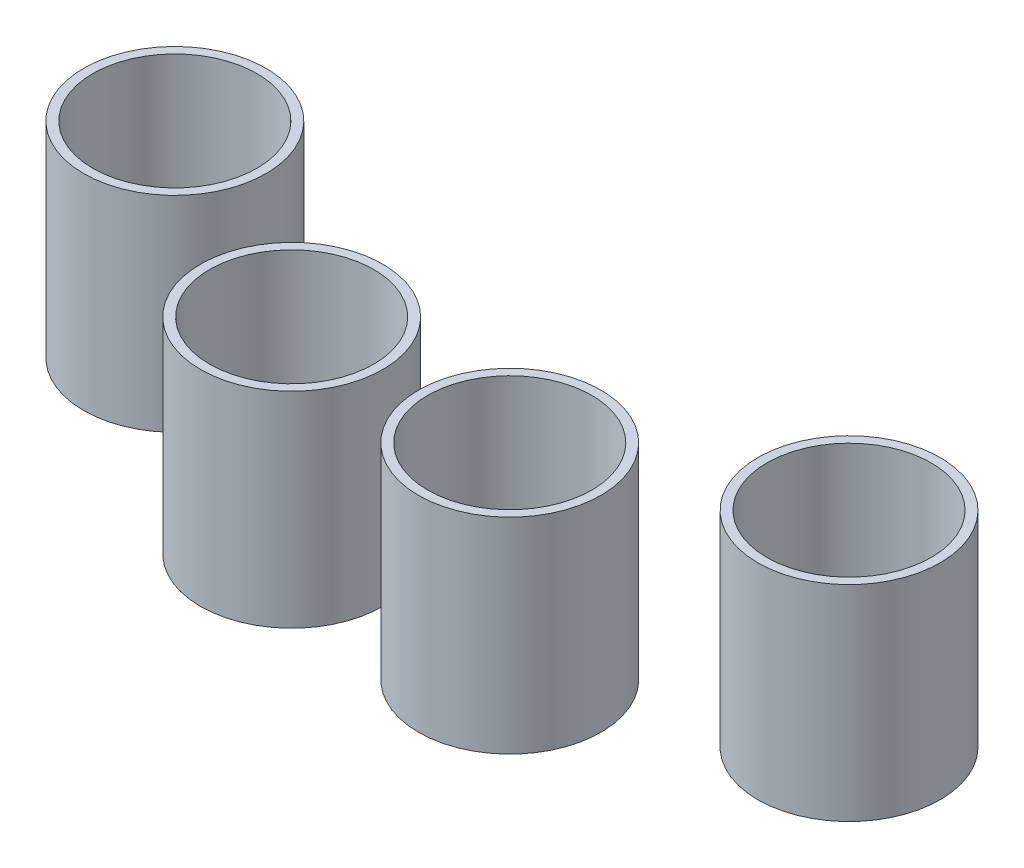
ISO-10303-21;
HEADER;
FILE_DESCRIPTION(('STEP AP214'),'2;1');
FILE_NAME('part.step','',(''),(''),'','','');
FILE_SCHEMA(('AUTOMOTIVE_DESIGN { 1 0 10303 214 1 1 1 1 }'));
ENDSEC;
DATA;
#1=APPLICATION_CONTEXT('core data for automotive mechanical design processes');
#2=APPLICATION_PROTOCOL_DEFINITION('international standard','automotive_design',2000,#1);
#3=PRODUCT_CONTEXT('',#1,'mechanical');
#4=PRODUCT('Part','Part','',(#3));
#5=PRODUCT_RELATED_PRODUCT_CATEGORY('part','',(#4));
#6=PRODUCT_DEFINITION_FORMATION('','',#4);
#7=PRODUCT_DEFINITION_CONTEXT('part definition',#1,'design');
#8=PRODUCT_DEFINITION('design','',#6,#7);
#9=PRODUCT_DEFINITION_SHAPE('','',#8);
#10=(LENGTH_UNIT() NAMED_UNIT(*) SI_UNIT(.MILLI.,.METRE.));
#11=(NAMED_UNIT(*) PLANE_ANGLE_UNIT() SI_UNIT($,.RADIAN.));
#12=(NAMED_UNIT(*) SI_UNIT($,.STERADIAN.) SOLID_ANGLE_UNIT());
#13=UNCERTAINTY_MEASURE_WITH_UNIT(LENGTH_MEASURE(1.E-05),#10,'distance_accuracy_value','');
#14=(GEOMETRIC_REPRESENTATION_CONTEXT(3) GLOBAL_UNCERTAINTY_ASSIGNED_CONTEXT((#13)) GLOBAL_UNIT_ASSIGNED_CONTEXT((#10,
#11,#12)) REPRESENTATION_CONTEXT('',''));
#15=CARTESIAN_POINT('',(0.,0.,0.));
#16=DIRECTION('',(0.,0.,1.));
#17=DIRECTION('',(1.,0.,0.));
#18=AXIS2_PLACEMENT_3D('',#15,#16,#17);
#19=CARTESIAN_POINT('',(147.841150227904,90.,176.190221917365));
#20=DIRECTION('',(0.,-1.,0.));
#21=DIRECTION('',(0.,0.,-1.));
#22=AXIS2_PLACEMENT_3D('',#19,#20,#21);
#23=CYLINDRICAL_SURFACE('',#22,40.);
#24=CARTESIAN_POINT('',(147.841150227904,90.,176.190221917365));
#25=DIRECTION('',(0.,1.,0.));
#26=DIRECTION('',(0.,0.,1.));
#27=AXIS2_PLACEMENT_3D('',#24,#25,#26);
#28=CIRCLE('',#27,40.);
#29=CARTESIAN_POINT('',(147.841150227904,90.,216.190221917365));
#30=VERTEX_POINT('',#29);
#31=EDGE_CURVE('E13',#30,#30,#28,.T.);
#32=ORIENTED_EDGE('',*,*,#31,.F.);
#33=EDGE_LOOP('',(#32));
#34=FACE_BOUND('',#33,.T.);
#35=CARTESIAN_POINT('',(147.841150227904,0.,176.190221917365));
#36=DIRECTION('',(0.,1.,0.));
#37=DIRECTION('',(0.,0.,1.));
#38=AXIS2_PLACEMENT_3D('',#35,#36,#37);
#39=CIRCLE('',#38,40.);
#40=CARTESIAN_POINT('',(147.841150227904,0.,216.190221917365));
#41=VERTEX_POINT('',#40);
#42=EDGE_CURVE('E58',#41,#41,#39,.T.);
#43=ORIENTED_EDGE('',*,*,#42,.T.);
#44=EDGE_LOOP('',(#43));
#45=FACE_BOUND('',#44,.T.);
#46=ADVANCED_FACE('F55',(#34,#45),#23,.T.);
#47=CARTESIAN_POINT('',(147.841150227904,90.,176.190221917365));
#48=DIRECTION('',(0.,1.,0.));
#49=DIRECTION('',(0.,0.,1.));
#50=AXIS2_PLACEMENT_3D('',#47,#48,#49);
#51=PLANE('',#50);
#52=CARTESIAN_POINT('',(147.841150227904,90.,176.190221917365));
#53=DIRECTION('',(0.,1.,0.));
#54=DIRECTION('',(0.,0.,1.));
#55=AXIS2_PLACEMENT_3D('',#52,#53,#54);
#56=CIRCLE('',#55,36.);
#57=CARTESIAN_POINT('',(147.841150227904,90.,212.190221917365));
#58=VERTEX_POINT('',#57);
#59=EDGE_CURVE('E67',#58,#58,#56,.T.);
#60=ORIENTED_EDGE('',*,*,#59,.F.);
#61=EDGE_LOOP('',(#60));
#62=FACE_BOUND('',#61,.T.);
#63=ORIENTED_EDGE('',*,*,#31,.T.);
#64=EDGE_LOOP('',(#63));
#65=FACE_BOUND('',#64,.T.);
#66=ADVANCED_FACE('F82',(#62,#65),#51,.T.);
#67=CARTESIAN_POINT('',(147.841150227904,0.,176.190221917365));
#68=DIRECTION('',(0.,1.,0.));
#69=DIRECTION('',(0.,0.,1.));
#70=AXIS2_PLACEMENT_3D('',#67,#68,#69);
#71=PLANE('',#70);
#72=ORIENTED_EDGE('',*,*,#42,.F.);
#73=EDGE_LOOP('',(#72));
#74=FACE_BOUND('',#73,.T.);
#75=ADVANCED_FACE('F78',(#74),#71,.F.);
#76=CARTESIAN_POINT('',(147.841150227904,9.99999999999999,176.190221917365));
#77=DIRECTION('',(0.,1.,0.));
#78=DIRECTION('',(0.,0.,1.));
#79=AXIS2_PLACEMENT_3D('',#76,#77,#78);
#80=CYLINDRICAL_SURFACE('',#79,36.);
#81=CARTESIAN_POINT('',(147.841150227904,9.99999999999999,176.190221917365));
#82=DIRECTION('',(0.,1.,0.));
#83=DIRECTION('',(0.,0.,1.));
#84=AXIS2_PLACEMENT_3D('',#81,#82,#83);
#85=CIRCLE('',#84,36.);
#86=CARTESIAN_POINT('',(147.841150227904,9.99999999999999,212.190221917365));
#87=VERTEX_POINT('',#86);
#88=EDGE_CURVE('E65',#87,#87,#85,.T.);
#89=ORIENTED_EDGE('',*,*,#88,.F.);
#90=EDGE_LOOP('',(#89));
#91=FACE_BOUND('',#90,.T.);
#92=ORIENTED_EDGE('',*,*,#59,.T.);
#93=EDGE_LOOP('',(#92));
#94=FACE_BOUND('',#93,.T.);
#95=ADVANCED_FACE('F75',(#91,#94),#80,.F.);
#96=CARTESIAN_POINT('',(147.841150227904,9.99999999999999,176.190221917365));
#97=DIRECTION('',(0.,1.,0.));
#98=DIRECTION('',(0.,0.,1.));
#99=AXIS2_PLACEMENT_3D('',#96,#97,#98);
#100=PLANE('',#99);
#101=ORIENTED_EDGE('',*,*,#88,.T.);
#102=EDGE_LOOP('',(#101));
#103=FACE_BOUND('',#102,.T.);
#104=ADVANCED_FACE('F73',(#103),#100,.T.);
#105=CLOSED_SHELL('',(#46,#66,#75,#95,#104));
#106=MANIFOLD_SOLID_BREP('B2',#105);
#107=CARTESIAN_POINT('',(47.819688888084,90.,224.973948168775));
#108=DIRECTION('',(0.,-1.,0.));
#109=DIRECTION('',(0.,0.,-1.));
#110=AXIS2_PLACEMENT_3D('',#107,#108,#109);
#111=CYLINDRICAL_SURFACE('',#110,40.);
#112=CARTESIAN_POINT('',(47.819688888084,90.,224.973948168775));
#113=DIRECTION('',(0.,1.,0.));
#114=DIRECTION('',(0.,0.,1.));
#115=AXIS2_PLACEMENT_3D('',#112,#113,#114);
#116=CIRCLE('',#115,40.);
#117=CARTESIAN_POINT('',(47.819688888084,90.,264.973948168775));
#118=VERTEX_POINT('',#117);
#119=EDGE_CURVE('E54',#118,#118,#116,.T.);
#120=ORIENTED_EDGE('',*,*,#119,.F.);
#121=EDGE_LOOP('',(#120));
#122=FACE_BOUND('',#121,.T.);
#123=CARTESIAN_POINT('',(47.819688888084,0.,224.973948168775));
#124=DIRECTION('',(0.,1.,0.));
#125=DIRECTION('',(0.,0.,1.));
#126=AXIS2_PLACEMENT_3D('',#123,#124,#125);
#127=CIRCLE('',#126,40.);
#128=CARTESIAN_POINT('',(47.819688888084,0.,264.973948168775));
#129=VERTEX_POINT('',#128);
#130=EDGE_CURVE('E144',#129,#129,#127,.T.);
#131=ORIENTED_EDGE('',*,*,#130,.T.);
#132=EDGE_LOOP('',(#131));
#133=FACE_BOUND('',#132,.T.);
#134=ADVANCED_FACE('F141',(#122,#133),#111,.T.);
#135=CARTESIAN_POINT('',(47.819688888084,90.,224.973948168775));
#136=DIRECTION('',(0.,1.,0.));
#137=DIRECTION('',(0.,0.,1.));
#138=AXIS2_PLACEMENT_3D('',#135,#136,#137);
#139=PLANE('',#138);
#140=CARTESIAN_POINT('',(47.819688888084,90.,224.973948168775));
#141=DIRECTION('',(0.,1.,0.));
#142=DIRECTION('',(0.,0.,1.));
#143=AXIS2_PLACEMENT_3D('',#140,#141,#142);
#144=CIRCLE('',#143,36.);
#145=CARTESIAN_POINT('',(47.819688888084,90.,260.973948168775));
#146=VERTEX_POINT('',#145);
#147=EDGE_CURVE('E153',#146,#146,#144,.T.);
#148=ORIENTED_EDGE('',*,*,#147,.F.);
#149=EDGE_LOOP('',(#148));
#150=FACE_BOUND('',#149,.T.);
#151=ORIENTED_EDGE('',*,*,#119,.T.);
#152=EDGE_LOOP('',(#151));
#153=FACE_BOUND('',#152,.T.);
#154=ADVANCED_FACE('F168',(#150,#153),#139,.T.);
#155=CARTESIAN_POINT('',(47.819688888084,0.,224.973948168775));
#156=DIRECTION('',(0.,1.,0.));
#157=DIRECTION('',(0.,0.,1.));
#158=AXIS2_PLACEMENT_3D('',#155,#156,#157);
#159=PLANE('',#158);
#160=ORIENTED_EDGE('',*,*,#130,.F.);
#161=EDGE_LOOP('',(#160));
#162=FACE_BOUND('',#161,.T.);
#163=ADVANCED_FACE('F164',(#162),#159,.F.);
#164=CARTESIAN_POINT('',(47.819688888084,9.99999999999999,224.973948168775));
#165=DIRECTION('',(0.,1.,0.));
#166=DIRECTION('',(0.,0.,1.));
#167=AXIS2_PLACEMENT_3D('',#164,#165,#166);
#168=CYLINDRICAL_SURFACE('',#167,36.);
#169=CARTESIAN_POINT('',(47.819688888084,9.99999999999999,224.973948168775));
#170=DIRECTION('',(0.,1.,0.));
#171=DIRECTION('',(0.,0.,1.));
#172=AXIS2_PLACEMENT_3D('',#169,#170,#171);
#173=CIRCLE('',#172,36.);
#174=CARTESIAN_POINT('',(47.819688888084,9.99999999999999,260.973948168775));
#175=VERTEX_POINT('',#174);
#176=EDGE_CURVE('E151',#175,#175,#173,.T.);
#177=ORIENTED_EDGE('',*,*,#176,.F.);
#178=EDGE_LOOP('',(#177));
#179=FACE_BOUND('',#178,.T.);
#180=ORIENTED_EDGE('',*,*,#147,.T.);
#181=EDGE_LOOP('',(#180));
#182=FACE_BOUND('',#181,.T.);
#183=ADVANCED_FACE('F161',(#179,#182),#168,.F.);
#184=CARTESIAN_POINT('',(47.819688888084,9.99999999999999,224.973948168775));
#185=DIRECTION('',(0.,1.,0.));
#186=DIRECTION('',(0.,0.,1.));
#187=AXIS2_PLACEMENT_3D('',#184,#185,#186);
#188=PLANE('',#187);
#189=ORIENTED_EDGE('',*,*,#176,.T.);
#190=EDGE_LOOP('',(#189));
#191=FACE_BOUND('',#190,.T.);
#192=ADVANCED_FACE('F159',(#191),#188,.T.);
#193=CLOSED_SHELL('',(#134,#154,#163,#183,#192));
#194=MANIFOLD_SOLID_BREP('B8',#193);
#195=CARTESIAN_POINT('',(-47.819688888084,90.,224.973948168775));
#196=DIRECTION('',(0.,-1.,0.));
#197=DIRECTION('',(0.,0.,-1.));
#198=AXIS2_PLACEMENT_3D('',#195,#196,#197);
#199=CYLINDRICAL_SURFACE('',#198,40.);
#200=CARTESIAN_POINT('',(-47.819688888084,90.,224.973948168775));
#201=DIRECTION('',(0.,1.,0.));
#202=DIRECTION('',(0.,0.,1.));
#203=AXIS2_PLACEMENT_3D('',#200,#201,#202);
#204=CIRCLE('',#203,40.);
#205=CARTESIAN_POINT('',(-47.819688888084,90.,264.973948168775));
#206=VERTEX_POINT('',#205);
#207=EDGE_CURVE('E140',#206,#206,#204,.T.);
#208=ORIENTED_EDGE('',*,*,#207,.F.);
#209=EDGE_LOOP('',(#208));
#210=FACE_BOUND('',#209,.T.);
#211=CARTESIAN_POINT('',(-47.819688888084,0.,224.973948168775));
#212=DIRECTION('',(0.,1.,0.));
#213=DIRECTION('',(0.,0.,1.));
#214=AXIS2_PLACEMENT_3D('',#211,#212,#213);
#215=CIRCLE('',#214,40.);
#216=CARTESIAN_POINT('',(-47.819688888084,0.,264.973948168775));
#217=VERTEX_POINT('',#216);
#218=EDGE_CURVE('E229',#217,#217,#215,.T.);
#219=ORIENTED_EDGE('',*,*,#218,.T.);
#220=EDGE_LOOP('',(#219));
#221=FACE_BOUND('',#220,.T.);
#222=ADVANCED_FACE('F226',(#210,#221),#199,.T.);
#223=CARTESIAN_POINT('',(-47.819688888084,90.,224.973948168775));
#224=DIRECTION('',(0.,1.,0.));
#225=DIRECTION('',(0.,0.,1.));
#226=AXIS2_PLACEMENT_3D('',#223,#224,#225);
#227=PLANE('',#226);
#228=CARTESIAN_POINT('',(-47.819688888084,90.,224.973948168775));
#229=DIRECTION('',(0.,1.,0.));
#230=DIRECTION('',(0.,0.,1.));
#231=AXIS2_PLACEMENT_3D('',#228,#229,#230);
#232=CIRCLE('',#231,36.);
#233=CARTESIAN_POINT('',(-47.819688888084,90.,260.973948168775));
#234=VERTEX_POINT('',#233);
#235=EDGE_CURVE('E238',#234,#234,#232,.T.);
#236=ORIENTED_EDGE('',*,*,#235,.F.);
#237=EDGE_LOOP('',(#236));
#238=FACE_BOUND('',#237,.T.);
#239=ORIENTED_EDGE('',*,*,#207,.T.);
#240=EDGE_LOOP('',(#239));
#241=FACE_BOUND('',#240,.T.);
#242=ADVANCED_FACE('F253',(#238,#241),#227,.T.);
#243=CARTESIAN_POINT('',(-47.819688888084,0.,224.973948168775));
#244=DIRECTION('',(0.,1.,0.));
#245=DIRECTION('',(0.,0.,1.));
#246=AXIS2_PLACEMENT_3D('',#243,#244,#245);
#247=PLANE('',#246);
#248=ORIENTED_EDGE('',*,*,#218,.F.);
#249=EDGE_LOOP('',(#248));
#250=FACE_BOUND('',#249,.T.);
#251=ADVANCED_FACE('F249',(#250),#247,.F.);
#252=CARTESIAN_POINT('',(-47.819688888084,9.99999999999999,224.973948168775));
#253=DIRECTION('',(0.,1.,0.));
#254=DIRECTION('',(0.,0.,1.));
#255=AXIS2_PLACEMENT_3D('',#252,#253,#254);
#256=CYLINDRICAL_SURFACE('',#255,36.);
#257=CARTESIAN_POINT('',(-47.819688888084,9.99999999999999,224.973948168775));
#258=DIRECTION('',(0.,1.,0.));
#259=DIRECTION('',(0.,0.,1.));
#260=AXIS2_PLACEMENT_3D('',#257,#258,#259);
#261=CIRCLE('',#260,36.);
#262=CARTESIAN_POINT('',(-47.819688888084,9.99999999999999,260.973948168775));
#263=VERTEX_POINT('',#262);
#264=EDGE_CURVE('E236',#263,#263,#261,.T.);
#265=ORIENTED_EDGE('',*,*,#264,.F.);
#266=EDGE_LOOP('',(#265));
#267=FACE_BOUND('',#266,.T.);
#268=ORIENTED_EDGE('',*,*,#235,.T.);
#269=EDGE_LOOP('',(#268));
#270=FACE_BOUND('',#269,.T.);
#271=ADVANCED_FACE('F246',(#267,#270),#256,.F.);
#272=CARTESIAN_POINT('',(-47.819688888084,9.99999999999999,224.973948168775));
#273=DIRECTION('',(0.,1.,0.));
#274=DIRECTION('',(0.,0.,1.));
#275=AXIS2_PLACEMENT_3D('',#272,#273,#274);
#276=PLANE('',#275);
#277=ORIENTED_EDGE('',*,*,#264,.T.);
#278=EDGE_LOOP('',(#277));
#279=FACE_BOUND('',#278,.T.);
#280=ADVANCED_FACE('F244',(#279),#276,.T.);
#281=CLOSED_SHELL('',(#222,#242,#251,#271,#280));
#282=MANIFOLD_SOLID_BREP('B49',#281);
#283=CARTESIAN_POINT('',(-147.841150227904,90.,176.190221917365));
#284=DIRECTION('',(0.,-1.,0.));
#285=DIRECTION('',(0.,0.,-1.));
#286=AXIS2_PLACEMENT_3D('',#283,#284,#285);
#287=CYLINDRICAL_SURFACE('',#286,40.);
#288=CARTESIAN_POINT('',(-147.841150227904,90.,176.190221917365));
#289=DIRECTION('',(0.,1.,0.));
#290=DIRECTION('',(0.,0.,1.));
#291=AXIS2_PLACEMENT_3D('',#288,#289,#290);
#292=CIRCLE('',#291,40.);
#293=CARTESIAN_POINT('',(-147.841150227904,90.,216.190221917365));
#294=VERTEX_POINT('',#293);
#295=EDGE_CURVE('E225',#294,#294,#292,.T.);
#296=ORIENTED_EDGE('',*,*,#295,.F.);
#297=EDGE_LOOP('',(#296));
#298=FACE_BOUND('',#297,.T.);
#299=CARTESIAN_POINT('',(-147.841150227904,0.,176.190221917365));
#300=DIRECTION('',(0.,1.,0.));
#301=DIRECTION('',(0.,0.,1.));
#302=AXIS2_PLACEMENT_3D('',#299,#300,#301);
#303=CIRCLE('',#302,40.);
#304=CARTESIAN_POINT('',(-147.841150227904,0.,216.190221917365));
#305=VERTEX_POINT('',#304);
#306=EDGE_CURVE('E305',#305,#305,#303,.T.);
#307=ORIENTED_EDGE('',*,*,#306,.T.);
#308=EDGE_LOOP('',(#307));
#309=FACE_BOUND('',#308,.T.);
#310=ADVANCED_FACE('F302',(#298,#309),#287,.T.);
#311=CARTESIAN_POINT('',(-147.841150227904,90.,176.190221917365));
#312=DIRECTION('',(0.,1.,0.));
#313=DIRECTION('',(0.,0.,1.));
#314=AXIS2_PLACEMENT_3D('',#311,#312,#313);
#315=PLANE('',#314);
#316=CARTESIAN_POINT('',(-147.841150227904,90.,176.190221917365));
#317=DIRECTION('',(0.,1.,0.));
#318=DIRECTION('',(0.,0.,1.));
#319=AXIS2_PLACEMENT_3D('',#316,#317,#318);
#320=CIRCLE('',#319,36.);
#321=CARTESIAN_POINT('',(-147.841150227904,90.,212.190221917365));
#322=VERTEX_POINT('',#321);
#323=EDGE_CURVE('E314',#322,#322,#320,.T.);
#324=ORIENTED_EDGE('',*,*,#323,.F.);
#325=EDGE_LOOP('',(#324));
#326=FACE_BOUND('',#325,.T.);
#327=ORIENTED_EDGE('',*,*,#295,.T.);
#328=EDGE_LOOP('',(#327));
#329=FACE_BOUND('',#328,.T.);
#330=ADVANCED_FACE('F329',(#326,#329),#315,.T.);
#331=CARTESIAN_POINT('',(-147.841150227904,0.,176.190221917365));
#332=DIRECTION('',(0.,1.,0.));
#333=DIRECTION('',(0.,0.,1.));
#334=AXIS2_PLACEMENT_3D('',#331,#332,#333);
#335=PLANE('',#334);
#336=ORIENTED_EDGE('',*,*,#306,.F.);
#337=EDGE_LOOP('',(#336));
#338=FACE_BOUND('',#337,.T.);
#339=ADVANCED_FACE('F325',(#338),#335,.F.);
#340=CARTESIAN_POINT('',(-147.841150227904,9.99999999999999,176.190221917365));
#341=DIRECTION('',(0.,1.,0.));
#342=DIRECTION('',(0.,0.,1.));
#343=AXIS2_PLACEMENT_3D('',#340,#341,#342);
#344=CYLINDRICAL_SURFACE('',#343,36.);
#345=CARTESIAN_POINT('',(-147.841150227904,9.99999999999999,176.190221917365));
#346=DIRECTION('',(0.,1.,0.));
#347=DIRECTION('',(0.,0.,1.));
#348=AXIS2_PLACEMENT_3D('',#345,#346,#347);
#349=CIRCLE('',#348,36.);
#350=CARTESIAN_POINT('',(-147.841150227904,9.99999999999999,212.190221917365));
#351=VERTEX_POINT('',#350);
#352=EDGE_CURVE('E312',#351,#351,#349,.T.);
#353=ORIENTED_EDGE('',*,*,#352,.F.);
#354=EDGE_LOOP('',(#353));
#355=FACE_BOUND('',#354,.T.);
#356=ORIENTED_EDGE('',*,*,#323,.T.);
#357=EDGE_LOOP('',(#356));
#358=FACE_BOUND('',#357,.T.);
#359=ADVANCED_FACE('F322',(#355,#358),#344,.F.);
#360=CARTESIAN_POINT('',(-147.841150227904,9.99999999999999,176.190221917365));
#361=DIRECTION('',(0.,1.,0.));
#362=DIRECTION('',(0.,0.,1.));
#363=AXIS2_PLACEMENT_3D('',#360,#361,#362);
#364=PLANE('',#363);
#365=ORIENTED_EDGE('',*,*,#352,.T.);
#366=EDGE_LOOP('',(#365));
#367=FACE_BOUND('',#366,.T.);
#368=ADVANCED_FACE('F320',(#367),#364,.T.);
#369=CLOSED_SHELL('',(#310,#330,#339,#359,#368));
#370=MANIFOLD_SOLID_BREP('B135',#369);
#371=ADVANCED_BREP_SHAPE_REPRESENTATION('',(#18,#106,#194,#282,#370),#14);
#372=SHAPE_DEFINITION_REPRESENTATION(#9,#371);
ENDSEC;
END-ISO-10303-21;
